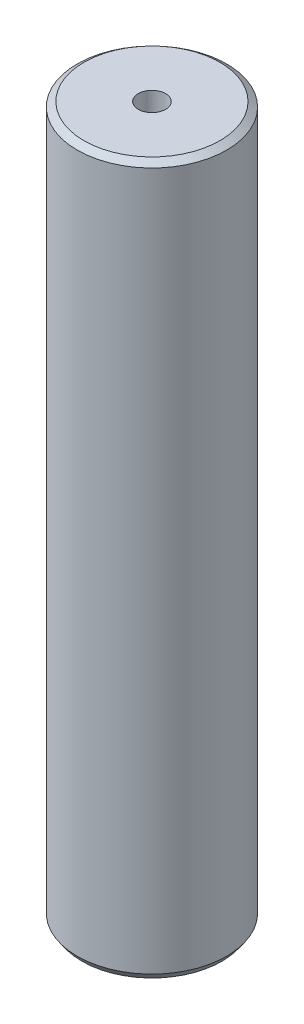
ISO-10303-21;
HEADER;
FILE_DESCRIPTION(('STEP AP214'),'2;1');
FILE_NAME('part.step','',(''),(''),'','','');
FILE_SCHEMA(('AUTOMOTIVE_DESIGN { 1 0 10303 214 1 1 1 1 }'));
ENDSEC;
DATA;
#1=APPLICATION_CONTEXT('core data for automotive mechanical design processes');
#2=APPLICATION_PROTOCOL_DEFINITION('international standard','automotive_design',2000,#1);
#3=PRODUCT_CONTEXT('',#1,'mechanical');
#4=PRODUCT('Part','Part','',(#3));
#5=PRODUCT_RELATED_PRODUCT_CATEGORY('part','',(#4));
#6=PRODUCT_DEFINITION_FORMATION('','',#4);
#7=PRODUCT_DEFINITION_CONTEXT('part definition',#1,'design');
#8=PRODUCT_DEFINITION('design','',#6,#7);
#9=PRODUCT_DEFINITION_SHAPE('','',#8);
#10=(LENGTH_UNIT() NAMED_UNIT(*) SI_UNIT(.MILLI.,.METRE.));
#11=(NAMED_UNIT(*) PLANE_ANGLE_UNIT() SI_UNIT($,.RADIAN.));
#12=(NAMED_UNIT(*) SI_UNIT($,.STERADIAN.) SOLID_ANGLE_UNIT());
#13=UNCERTAINTY_MEASURE_WITH_UNIT(LENGTH_MEASURE(1.E-05),#10,'distance_accuracy_value','');
#14=(GEOMETRIC_REPRESENTATION_CONTEXT(3) GLOBAL_UNCERTAINTY_ASSIGNED_CONTEXT((#13)) GLOBAL_UNIT_ASSIGNED_CONTEXT((#10,
#11,#12)) REPRESENTATION_CONTEXT('',''));
#15=CARTESIAN_POINT('',(0.,0.,0.));
#16=DIRECTION('',(0.,0.,1.));
#17=DIRECTION('',(1.,0.,0.));
#18=AXIS2_PLACEMENT_3D('',#15,#16,#17);
#19=CARTESIAN_POINT('',(0.,47.4859320027286,0.));
#20=DIRECTION('',(0.,-1.,0.));
#21=DIRECTION('',(0.,0.,-1.));
#22=AXIS2_PLACEMENT_3D('',#19,#20,#21);
#23=CYLINDRICAL_SURFACE('',#22,5.);
#24=CARTESIAN_POINT('',(0.,47.1653382165772,0.));
#25=DIRECTION('',(0.,1.,0.));
#26=DIRECTION('',(0.,0.,1.));
#27=AXIS2_PLACEMENT_3D('',#24,#25,#26);
#28=CIRCLE('',#27,5.);
#29=CARTESIAN_POINT('',(0.,47.1653382165772,5.));
#30=VERTEX_POINT('',#29);
#31=EDGE_CURVE('E50',#30,#30,#28,.F.);
#32=ORIENTED_EDGE('',*,*,#31,.T.);
#33=EDGE_LOOP('',(#32));
#34=FACE_BOUND('',#33,.T.);
#35=CARTESIAN_POINT('',(0.,0.452816816475431,0.));
#36=DIRECTION('',(0.,1.,0.));
#37=DIRECTION('',(0.,0.,1.));
#38=AXIS2_PLACEMENT_3D('',#35,#36,#37);
#39=CIRCLE('',#38,5.);
#40=CARTESIAN_POINT('',(0.,0.452816816475431,5.));
#41=VERTEX_POINT('',#40);
#42=EDGE_CURVE('E51',#41,#41,#39,.T.);
#43=ORIENTED_EDGE('',*,*,#42,.T.);
#44=EDGE_LOOP('',(#43));
#45=FACE_BOUND('',#44,.T.);
#46=ADVANCED_FACE('F39',(#34,#45),#23,.T.);
#47=CARTESIAN_POINT('',(0.,47.4859320027286,0.));
#48=DIRECTION('',(0.,1.,0.));
#49=DIRECTION('',(0.,0.,1.));
#50=AXIS2_PLACEMENT_3D('',#47,#48,#49);
#51=PLANE('',#50);
#52=CARTESIAN_POINT('',(0.,47.4859320027286,0.));
#53=DIRECTION('',(0.,1.,0.));
#54=DIRECTION('',(0.,0.,1.));
#55=AXIS2_PLACEMENT_3D('',#52,#53,#54);
#56=CIRCLE('',#55,4.54718318352457);
#57=CARTESIAN_POINT('',(0.,47.4859320027286,4.54718318352457));
#58=VERTEX_POINT('',#57);
#59=EDGE_CURVE('E54',#58,#58,#56,.T.);
#60=ORIENTED_EDGE('',*,*,#59,.T.);
#61=EDGE_LOOP('',(#60));
#62=FACE_BOUND('',#61,.T.);
#63=CARTESIAN_POINT('',(0.,47.4859320027286,0.));
#64=DIRECTION('',(0.,1.,0.));
#65=DIRECTION('',(0.,0.,1.));
#66=AXIS2_PLACEMENT_3D('',#63,#64,#65);
#67=CIRCLE('',#66,0.914512624234518);
#68=CARTESIAN_POINT('',(0.,47.4859320027286,0.914512624234518));
#69=VERTEX_POINT('',#68);
#70=EDGE_CURVE('E58',#69,#69,#67,.T.);
#71=ORIENTED_EDGE('',*,*,#70,.F.);
#72=EDGE_LOOP('',(#71));
#73=FACE_BOUND('',#72,.T.);
#74=ADVANCED_FACE('F69',(#62,#73),#51,.T.);
#75=CARTESIAN_POINT('',(0.,0.,0.));
#76=DIRECTION('',(0.,1.,0.));
#77=DIRECTION('',(0.,0.,1.));
#78=AXIS2_PLACEMENT_3D('',#75,#76,#77);
#79=PLANE('',#78);
#80=CARTESIAN_POINT('',(0.,0.,0.));
#81=DIRECTION('',(0.,1.,0.));
#82=DIRECTION('',(0.,0.,1.));
#83=AXIS2_PLACEMENT_3D('',#80,#81,#82);
#84=CIRCLE('',#83,4.67940621384863);
#85=CARTESIAN_POINT('',(0.,0.,4.67940621384863));
#86=VERTEX_POINT('',#85);
#87=EDGE_CURVE('E10',#86,#86,#84,.F.);
#88=ORIENTED_EDGE('',*,*,#87,.T.);
#89=EDGE_LOOP('',(#88));
#90=FACE_BOUND('',#89,.T.);
#91=CARTESIAN_POINT('',(0.,0.,0.));
#92=DIRECTION('',(0.,1.,0.));
#93=DIRECTION('',(0.,0.,1.));
#94=AXIS2_PLACEMENT_3D('',#91,#92,#93);
#95=CIRCLE('',#94,0.914512624234518);
#96=CARTESIAN_POINT('',(0.,0.,0.914512624234518));
#97=VERTEX_POINT('',#96);
#98=EDGE_CURVE('E63',#97,#97,#95,.T.);
#99=ORIENTED_EDGE('',*,*,#98,.T.);
#100=EDGE_LOOP('',(#99));
#101=FACE_BOUND('',#100,.T.);
#102=ADVANCED_FACE('F75',(#90,#101),#79,.F.);
#103=CARTESIAN_POINT('',(0.,47.4859320027286,0.));
#104=DIRECTION('',(0.,-1.,0.));
#105=DIRECTION('',(0.,0.,-1.));
#106=AXIS2_PLACEMENT_3D('',#103,#104,#105);
#107=CYLINDRICAL_SURFACE('',#106,0.914512624234518);
#108=ORIENTED_EDGE('',*,*,#70,.T.);
#109=EDGE_LOOP('',(#108));
#110=FACE_BOUND('',#109,.T.);
#111=ORIENTED_EDGE('',*,*,#98,.F.);
#112=EDGE_LOOP('',(#111));
#113=FACE_BOUND('',#112,.T.);
#114=ADVANCED_FACE('F70',(#110,#113),#107,.F.);
#115=CARTESIAN_POINT('',(0.,47.4859320027286,0.));
#116=DIRECTION('',(0.,-1.,0.));
#117=DIRECTION('',(0.,0.,-1.));
#118=AXIS2_PLACEMENT_3D('',#115,#116,#117);
#119=CONICAL_SURFACE('',#118,4.54718318352457,0.954722154423517);
#120=ORIENTED_EDGE('',*,*,#31,.F.);
#121=EDGE_LOOP('',(#120));
#122=FACE_BOUND('',#121,.T.);
#123=ORIENTED_EDGE('',*,*,#59,.F.);
#124=EDGE_LOOP('',(#123));
#125=FACE_BOUND('',#124,.T.);
#126=ADVANCED_FACE('F81',(#122,#125),#119,.T.);
#127=CARTESIAN_POINT('',(0.,0.452816816475431,0.));
#128=DIRECTION('',(0.,1.,0.));
#129=DIRECTION('',(0.,0.,1.));
#130=AXIS2_PLACEMENT_3D('',#127,#128,#129);
#131=CONICAL_SURFACE('',#130,5.,0.616074172371362);
#132=ORIENTED_EDGE('',*,*,#87,.F.);
#133=EDGE_LOOP('',(#132));
#134=FACE_BOUND('',#133,.T.);
#135=ORIENTED_EDGE('',*,*,#42,.F.);
#136=EDGE_LOOP('',(#135));
#137=FACE_BOUND('',#136,.T.);
#138=ADVANCED_FACE('F45',(#134,#137),#131,.T.);
#139=CLOSED_SHELL('',(#46,#74,#102,#114,#126,#138));
#140=MANIFOLD_SOLID_BREP('B2',#139);
#141=ADVANCED_BREP_SHAPE_REPRESENTATION('',(#18,#140),#14);
#142=SHAPE_DEFINITION_REPRESENTATION(#9,#141);
ENDSEC;
END-ISO-10303-21;
